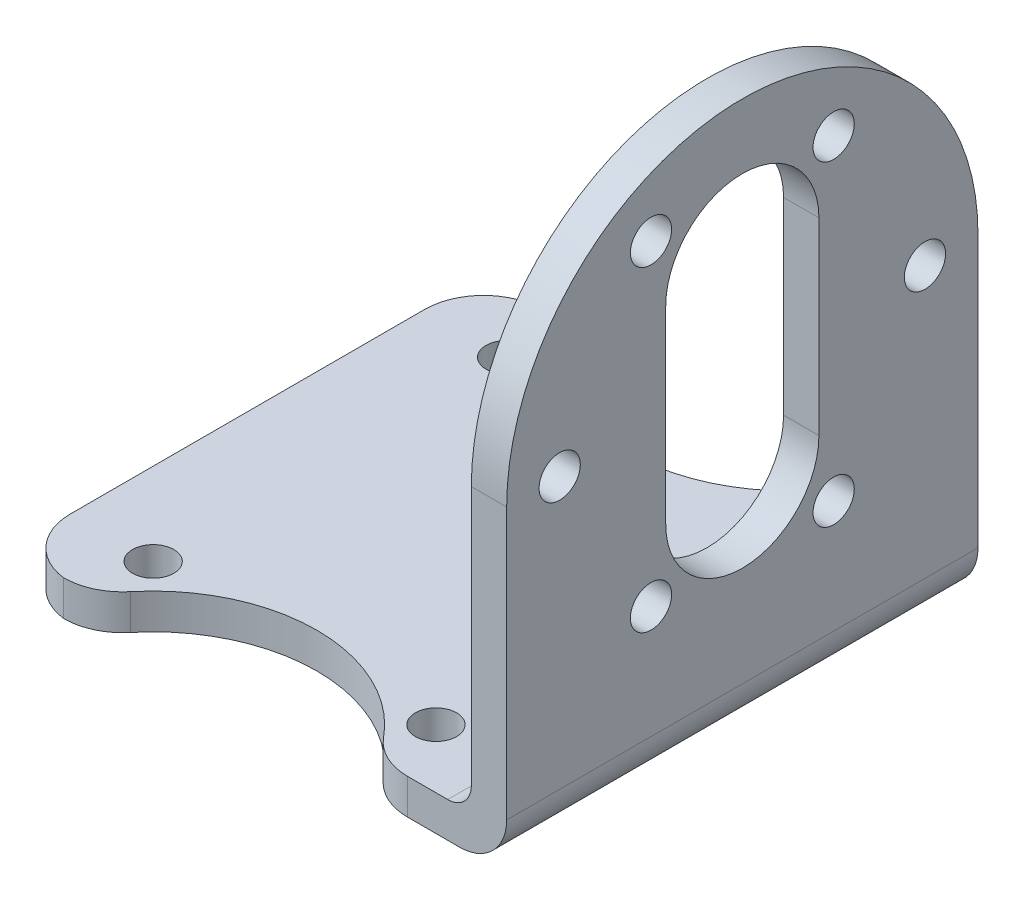
ISO-10303-21;
HEADER;
FILE_DESCRIPTION(('STEP AP214'),'2;1');
FILE_NAME('part.step','',(''),(''),'','','');
FILE_SCHEMA(('AUTOMOTIVE_DESIGN { 1 0 10303 214 1 1 1 1 }'));
ENDSEC;
DATA;
#1=APPLICATION_CONTEXT('core data for automotive mechanical design processes');
#2=APPLICATION_PROTOCOL_DEFINITION('international standard','automotive_design',2000,#1);
#3=PRODUCT_CONTEXT('',#1,'mechanical');
#4=PRODUCT('Part','Part','',(#3));
#5=PRODUCT_RELATED_PRODUCT_CATEGORY('part','',(#4));
#6=PRODUCT_DEFINITION_FORMATION('','',#4);
#7=PRODUCT_DEFINITION_CONTEXT('part definition',#1,'design');
#8=PRODUCT_DEFINITION('design','',#6,#7);
#9=PRODUCT_DEFINITION_SHAPE('','',#8);
#10=(LENGTH_UNIT() NAMED_UNIT(*) SI_UNIT(.MILLI.,.METRE.));
#11=(NAMED_UNIT(*) PLANE_ANGLE_UNIT() SI_UNIT($,.RADIAN.));
#12=(NAMED_UNIT(*) SI_UNIT($,.STERADIAN.) SOLID_ANGLE_UNIT());
#13=UNCERTAINTY_MEASURE_WITH_UNIT(LENGTH_MEASURE(1.E-05),#10,'distance_accuracy_value','');
#14=(GEOMETRIC_REPRESENTATION_CONTEXT(3) GLOBAL_UNCERTAINTY_ASSIGNED_CONTEXT((#13)) GLOBAL_UNIT_ASSIGNED_CONTEXT((#10,
#11,#12)) REPRESENTATION_CONTEXT('',''));
#15=CARTESIAN_POINT('',(0.,0.,0.));
#16=DIRECTION('',(0.,0.,1.));
#17=DIRECTION('',(1.,0.,0.));
#18=AXIS2_PLACEMENT_3D('',#15,#16,#17);
#19=CARTESIAN_POINT('',(-3.,0.,0.));
#20=DIRECTION('',(1.,0.,0.));
#21=DIRECTION('',(0.,0.,-1.));
#22=AXIS2_PLACEMENT_3D('',#19,#20,#21);
#23=PLANE('',#22);
#24=CARTESIAN_POINT('',(-3.,0.,15.5));
#25=DIRECTION('',(1.,0.,0.));
#26=DIRECTION('',(0.,0.,-1.));
#27=AXIS2_PLACEMENT_3D('',#24,#25,#26);
#28=CIRCLE('',#27,1.75);
#29=CARTESIAN_POINT('',(-3.,0.,13.75));
#30=VERTEX_POINT('',#29);
#31=EDGE_CURVE('E228',#30,#30,#28,.T.);
#32=ORIENTED_EDGE('',*,*,#31,.T.);
#33=EDGE_LOOP('',(#32));
#34=FACE_BOUND('',#33,.T.);
#35=CARTESIAN_POINT('',(-3.,13.4233937586588,7.74999999999997));
#36=DIRECTION('',(1.,0.,0.));
#37=DIRECTION('',(0.,0.,-1.));
#38=AXIS2_PLACEMENT_3D('',#35,#36,#37);
#39=CIRCLE('',#38,1.75);
#40=CARTESIAN_POINT('',(-3.,13.4233937586588,5.99999999999997));
#41=VERTEX_POINT('',#40);
#42=EDGE_CURVE('E225',#41,#41,#39,.T.);
#43=ORIENTED_EDGE('',*,*,#42,.T.);
#44=EDGE_LOOP('',(#43));
#45=FACE_BOUND('',#44,.T.);
#46=CARTESIAN_POINT('',(-3.,13.4233937586588,-7.75000000000006));
#47=DIRECTION('',(1.,0.,0.));
#48=DIRECTION('',(0.,0.,-1.));
#49=AXIS2_PLACEMENT_3D('',#46,#47,#48);
#50=CIRCLE('',#49,1.75);
#51=CARTESIAN_POINT('',(-3.,13.4233937586588,-9.50000000000006));
#52=VERTEX_POINT('',#51);
#53=EDGE_CURVE('E222',#52,#52,#50,.T.);
#54=ORIENTED_EDGE('',*,*,#53,.T.);
#55=EDGE_LOOP('',(#54));
#56=FACE_BOUND('',#55,.T.);
#57=CARTESIAN_POINT('',(-3.,-1.08235921504137E-13,-15.5));
#58=DIRECTION('',(1.,0.,0.));
#59=DIRECTION('',(0.,0.,-1.));
#60=AXIS2_PLACEMENT_3D('',#57,#58,#59);
#61=CIRCLE('',#60,1.75);
#62=CARTESIAN_POINT('',(-3.,-1.08235921504137E-13,-17.25));
#63=VERTEX_POINT('',#62);
#64=EDGE_CURVE('E219',#63,#63,#61,.T.);
#65=ORIENTED_EDGE('',*,*,#64,.T.);
#66=EDGE_LOOP('',(#65));
#67=FACE_BOUND('',#66,.T.);
#68=CARTESIAN_POINT('',(-3.,-13.4233937586589,-7.74999999999987));
#69=DIRECTION('',(1.,0.,0.));
#70=DIRECTION('',(0.,0.,-1.));
#71=AXIS2_PLACEMENT_3D('',#68,#69,#70);
#72=CIRCLE('',#71,1.75);
#73=CARTESIAN_POINT('',(-3.,-13.4233937586589,-9.49999999999988));
#74=VERTEX_POINT('',#73);
#75=EDGE_CURVE('E216',#74,#74,#72,.T.);
#76=ORIENTED_EDGE('',*,*,#75,.T.);
#77=EDGE_LOOP('',(#76));
#78=FACE_BOUND('',#77,.T.);
#79=CARTESIAN_POINT('',(-3.,-13.4233937586587,7.75000000000016));
#80=DIRECTION('',(1.,0.,0.));
#81=DIRECTION('',(0.,0.,-1.));
#82=AXIS2_PLACEMENT_3D('',#79,#80,#81);
#83=CIRCLE('',#82,1.75);
#84=CARTESIAN_POINT('',(-3.,-13.4233937586587,6.00000000000015));
#85=VERTEX_POINT('',#84);
#86=EDGE_CURVE('E213',#85,#85,#83,.T.);
#87=ORIENTED_EDGE('',*,*,#86,.T.);
#88=EDGE_LOOP('',(#87));
#89=FACE_BOUND('',#88,.T.);
#90=CARTESIAN_POINT('',(-3.,8.,0.));
#91=DIRECTION('',(1.,0.,0.));
#92=DIRECTION('',(0.,0.,-1.));
#93=AXIS2_PLACEMENT_3D('',#90,#91,#92);
#94=CIRCLE('',#93,6.5);
#95=CARTESIAN_POINT('',(-3.,8.,-6.5));
#96=VERTEX_POINT('',#95);
#97=CARTESIAN_POINT('',(-3.,8.,6.5));
#98=VERTEX_POINT('',#97);
#99=EDGE_CURVE('E179',#96,#98,#94,.T.);
#100=ORIENTED_EDGE('',*,*,#99,.T.);
#101=DIRECTION('',(0.,1.,0.));
#102=VECTOR('',#101,1.);
#103=CARTESIAN_POINT('',(-3.,0.,6.5));
#104=LINE('',#103,#102);
#105=CARTESIAN_POINT('',(-3.,-8.,6.5));
#106=VERTEX_POINT('',#105);
#107=EDGE_CURVE('E211',#106,#98,#104,.T.);
#108=ORIENTED_EDGE('',*,*,#107,.F.);
#109=CARTESIAN_POINT('',(-3.,-8.,0.));
#110=DIRECTION('',(1.,0.,0.));
#111=DIRECTION('',(0.,0.,-1.));
#112=AXIS2_PLACEMENT_3D('',#109,#110,#111);
#113=CIRCLE('',#112,6.5);
#114=CARTESIAN_POINT('',(-3.,-8.,-6.5));
#115=VERTEX_POINT('',#114);
#116=EDGE_CURVE('E182',#106,#115,#113,.T.);
#117=ORIENTED_EDGE('',*,*,#116,.T.);
#118=DIRECTION('',(0.,1.,0.));
#119=VECTOR('',#118,1.);
#120=CARTESIAN_POINT('',(-3.,0.,-6.5));
#121=LINE('',#120,#119);
#122=EDGE_CURVE('E175',#115,#96,#121,.T.);
#123=ORIENTED_EDGE('',*,*,#122,.T.);
#124=EDGE_LOOP('',(#100,#108,#117,#123));
#125=FACE_BOUND('',#124,.T.);
#126=DIRECTION('',(0.,-1.,0.));
#127=VECTOR('',#126,1.);
#128=CARTESIAN_POINT('',(-3.,0.,-20.));
#129=LINE('',#128,#127);
#130=CARTESIAN_POINT('',(-3.,0.,-20.));
#131=VERTEX_POINT('',#130);
#132=CARTESIAN_POINT('',(-3.,-22.,-20.));
#133=VERTEX_POINT('',#132);
#134=EDGE_CURVE('E196',#131,#133,#129,.T.);
#135=ORIENTED_EDGE('',*,*,#134,.T.);
#136=DIRECTION('',(0.,0.,-1.));
#137=VECTOR('',#136,1.);
#138=CARTESIAN_POINT('',(-3.,-22.,20.));
#139=LINE('',#138,#137);
#140=CARTESIAN_POINT('',(-3.,-22.,20.));
#141=VERTEX_POINT('',#140);
#142=EDGE_CURVE('E60',#133,#141,#139,.F.);
#143=ORIENTED_EDGE('',*,*,#142,.T.);
#144=DIRECTION('',(0.,-1.,0.));
#145=VECTOR('',#144,1.);
#146=CARTESIAN_POINT('',(-3.,0.,20.));
#147=LINE('',#146,#145);
#148=CARTESIAN_POINT('',(-3.,0.,20.));
#149=VERTEX_POINT('',#148);
#150=EDGE_CURVE('E234',#149,#141,#147,.T.);
#151=ORIENTED_EDGE('',*,*,#150,.F.);
#152=CARTESIAN_POINT('',(-3.,0.,0.));
#153=DIRECTION('',(1.,0.,0.));
#154=DIRECTION('',(0.,0.,-1.));
#155=AXIS2_PLACEMENT_3D('',#152,#153,#154);
#156=CIRCLE('',#155,20.);
#157=EDGE_CURVE('E231',#131,#149,#156,.T.);
#158=ORIENTED_EDGE('',*,*,#157,.F.);
#159=EDGE_LOOP('',(#135,#143,#151,#158));
#160=FACE_BOUND('',#159,.T.);
#161=ADVANCED_FACE('F39',(#34,#45,#56,#67,#78,#89,#125,#160),#23,.F.);
#162=CARTESIAN_POINT('',(-3.,0.,0.));
#163=DIRECTION('',(1.,0.,0.));
#164=DIRECTION('',(0.,0.,-1.));
#165=AXIS2_PLACEMENT_3D('',#162,#163,#164);
#166=CYLINDRICAL_SURFACE('',#165,20.);
#167=CARTESIAN_POINT('',(0.,0.,0.));
#168=DIRECTION('',(1.,0.,0.));
#169=DIRECTION('',(0.,0.,-1.));
#170=AXIS2_PLACEMENT_3D('',#167,#168,#169);
#171=CIRCLE('',#170,20.);
#172=CARTESIAN_POINT('',(0.,0.,-20.));
#173=VERTEX_POINT('',#172);
#174=CARTESIAN_POINT('',(0.,0.,20.));
#175=VERTEX_POINT('',#174);
#176=EDGE_CURVE('E264',#173,#175,#171,.T.);
#177=ORIENTED_EDGE('',*,*,#176,.F.);
#178=DIRECTION('',(1.,0.,0.));
#179=VECTOR('',#178,1.);
#180=CARTESIAN_POINT('',(-3.,0.,-20.));
#181=LINE('',#180,#179);
#182=EDGE_CURVE('E269',#131,#173,#181,.T.);
#183=ORIENTED_EDGE('',*,*,#182,.F.);
#184=ORIENTED_EDGE('',*,*,#157,.T.);
#185=DIRECTION('',(1.,0.,0.));
#186=VECTOR('',#185,1.);
#187=CARTESIAN_POINT('',(-3.,0.,20.));
#188=LINE('',#187,#186);
#189=EDGE_CURVE('E278',#149,#175,#188,.T.);
#190=ORIENTED_EDGE('',*,*,#189,.T.);
#191=EDGE_LOOP('',(#177,#183,#184,#190));
#192=FACE_BOUND('',#191,.T.);
#193=ADVANCED_FACE('F427',(#192),#166,.T.);
#194=CARTESIAN_POINT('',(-3.,0.,-20.));
#195=DIRECTION('',(0.,0.,1.));
#196=DIRECTION('',(0.,-1.,0.));
#197=AXIS2_PLACEMENT_3D('',#194,#195,#196);
#198=PLANE('',#197);
#199=DIRECTION('',(0.,-1.,0.));
#200=VECTOR('',#199,1.);
#201=CARTESIAN_POINT('',(0.,0.,-20.));
#202=LINE('',#201,#200);
#203=CARTESIAN_POINT('',(0.,-23.,-20.));
#204=VERTEX_POINT('',#203);
#205=EDGE_CURVE('E201',#173,#204,#202,.T.);
#206=ORIENTED_EDGE('',*,*,#205,.T.);
#207=CARTESIAN_POINT('',(-4.,-23.,-20.));
#208=DIRECTION('',(0.,0.,1.));
#209=DIRECTION('',(0.,-1.,0.));
#210=AXIS2_PLACEMENT_3D('',#207,#208,#209);
#211=CIRCLE('',#210,4.);
#212=CARTESIAN_POINT('',(-4.,-27.,-20.));
#213=VERTEX_POINT('',#212);
#214=EDGE_CURVE('E342',#204,#213,#211,.F.);
#215=ORIENTED_EDGE('',*,*,#214,.T.);
#216=DIRECTION('',(1.,0.,0.));
#217=VECTOR('',#216,1.);
#218=CARTESIAN_POINT('',(-3.,-27.,-20.));
#219=LINE('',#218,#217);
#220=CARTESIAN_POINT('',(-8.40806935685006,-27.,-20.));
#221=VERTEX_POINT('',#220);
#222=EDGE_CURVE('E272',#221,#213,#219,.T.);
#223=ORIENTED_EDGE('',*,*,#222,.F.);
#224=DIRECTION('',(0.,1.,0.));
#225=VECTOR('',#224,1.);
#226=CARTESIAN_POINT('',(-8.40806935685006,-24.,-20.));
#227=LINE('',#226,#225);
#228=CARTESIAN_POINT('',(-8.40806935685006,-24.,-20.));
#229=VERTEX_POINT('',#228);
#230=EDGE_CURVE('E311',#221,#229,#227,.T.);
#231=ORIENTED_EDGE('',*,*,#230,.T.);
#232=DIRECTION('',(-1.,0.,0.));
#233=VECTOR('',#232,1.);
#234=CARTESIAN_POINT('',(0.,-24.,-20.));
#235=LINE('',#234,#233);
#236=CARTESIAN_POINT('',(-5.,-24.,-20.));
#237=VERTEX_POINT('',#236);
#238=EDGE_CURVE('E355',#237,#229,#235,.T.);
#239=ORIENTED_EDGE('',*,*,#238,.F.);
#240=CARTESIAN_POINT('',(-5.,-22.,-20.));
#241=DIRECTION('',(0.,0.,1.));
#242=DIRECTION('',(0.,-1.,0.));
#243=AXIS2_PLACEMENT_3D('',#240,#241,#242);
#244=CIRCLE('',#243,2.);
#245=EDGE_CURVE('E47',#237,#133,#244,.T.);
#246=ORIENTED_EDGE('',*,*,#245,.T.);
#247=ORIENTED_EDGE('',*,*,#134,.F.);
#248=ORIENTED_EDGE('',*,*,#182,.T.);
#249=EDGE_LOOP('',(#206,#215,#223,#231,#239,#246,#247,#248));
#250=FACE_BOUND('',#249,.T.);
#251=ADVANCED_FACE('F359',(#250),#198,.F.);
#252=CARTESIAN_POINT('',(-3.,-27.,0.));
#253=DIRECTION('',(0.,-1.,0.));
#254=DIRECTION('',(0.,0.,-1.));
#255=AXIS2_PLACEMENT_3D('',#252,#253,#254);
#256=PLANE('',#255);
#257=ORIENTED_EDGE('',*,*,#222,.T.);
#258=DIRECTION('',(0.,0.,-1.));
#259=VECTOR('',#258,1.);
#260=CARTESIAN_POINT('',(-4.,-27.,0.));
#261=LINE('',#260,#259);
#262=CARTESIAN_POINT('',(-4.,-27.,20.));
#263=VERTEX_POINT('',#262);
#264=EDGE_CURVE('E344',#213,#263,#261,.F.);
#265=ORIENTED_EDGE('',*,*,#264,.T.);
#266=DIRECTION('',(1.,0.,0.));
#267=VECTOR('',#266,1.);
#268=CARTESIAN_POINT('',(-3.,-27.,20.));
#269=LINE('',#268,#267);
#270=CARTESIAN_POINT('',(-8.40806935685006,-27.,20.));
#271=VERTEX_POINT('',#270);
#272=EDGE_CURVE('E275',#271,#263,#269,.T.);
#273=ORIENTED_EDGE('',*,*,#272,.F.);
#274=CARTESIAN_POINT('',(-8.40806935685006,-27.,15.));
#275=DIRECTION('',(0.,-1.,0.));
#276=DIRECTION('',(0.,0.,-1.));
#277=AXIS2_PLACEMENT_3D('',#274,#275,#276);
#278=CIRCLE('',#277,5.);
#279=CARTESIAN_POINT('',(-12.2699123908425,-27.,18.1758728533749));
#280=VERTEX_POINT('',#279);
#281=EDGE_CURVE('E286',#271,#280,#278,.T.);
#282=ORIENTED_EDGE('',*,*,#281,.T.);
#283=CARTESIAN_POINT('',(-23.,-27.,27.));
#284=DIRECTION('',(0.,-1.,0.));
#285=DIRECTION('',(0.,0.,-1.));
#286=AXIS2_PLACEMENT_3D('',#283,#284,#285);
#287=CIRCLE('',#286,13.8924439894498);
#288=CARTESIAN_POINT('',(-33.7300876091575,-27.,18.1758728533749));
#289=VERTEX_POINT('',#288);
#290=EDGE_CURVE('E388',#289,#280,#287,.T.);
#291=ORIENTED_EDGE('',*,*,#290,.F.);
#292=CARTESIAN_POINT('',(-37.5919306431499,-27.,15.));
#293=DIRECTION('',(0.,-1.,0.));
#294=DIRECTION('',(0.,0.,-1.));
#295=AXIS2_PLACEMENT_3D('',#292,#293,#294);
#296=CIRCLE('',#295,5.);
#297=CARTESIAN_POINT('',(-37.5919306431499,-27.,20.));
#298=VERTEX_POINT('',#297);
#299=EDGE_CURVE('E298',#289,#298,#296,.T.);
#300=ORIENTED_EDGE('',*,*,#299,.T.);
#301=CARTESIAN_POINT('',(-37.,-27.,15.0351618240168));
#302=DIRECTION('',(0.,-1.,0.));
#303=DIRECTION('',(0.,0.,-1.));
#304=AXIS2_PLACEMENT_3D('',#301,#302,#303);
#305=CIRCLE('',#304,5.);
#306=CARTESIAN_POINT('',(-42.,-27.,15.0351618240168));
#307=VERTEX_POINT('',#306);
#308=EDGE_CURVE('E326',#298,#307,#305,.T.);
#309=ORIENTED_EDGE('',*,*,#308,.T.);
#310=DIRECTION('',(0.,0.,-1.));
#311=VECTOR('',#310,1.);
#312=CARTESIAN_POINT('',(-42.,-27.,0.));
#313=LINE('',#312,#311);
#314=CARTESIAN_POINT('',(-42.,-27.,-15.0351618240168));
#315=VERTEX_POINT('',#314);
#316=EDGE_CURVE('E207',#307,#315,#313,.T.);
#317=ORIENTED_EDGE('',*,*,#316,.T.);
#318=CARTESIAN_POINT('',(-37.,-27.,-15.0351618240168));
#319=DIRECTION('',(0.,-1.,0.));
#320=DIRECTION('',(0.,0.,-1.));
#321=AXIS2_PLACEMENT_3D('',#318,#319,#320);
#322=CIRCLE('',#321,5.);
#323=CARTESIAN_POINT('',(-37.5919306431499,-27.,-20.));
#324=VERTEX_POINT('',#323);
#325=EDGE_CURVE('E335',#315,#324,#322,.T.);
#326=ORIENTED_EDGE('',*,*,#325,.T.);
#327=CARTESIAN_POINT('',(-37.5919306431499,-27.,-15.));
#328=DIRECTION('',(0.,-1.,0.));
#329=DIRECTION('',(0.,0.,-1.));
#330=AXIS2_PLACEMENT_3D('',#327,#328,#329);
#331=CIRCLE('',#330,5.);
#332=CARTESIAN_POINT('',(-33.7300876091575,-27.,-18.1758728533749));
#333=VERTEX_POINT('',#332);
#334=EDGE_CURVE('E320',#324,#333,#331,.T.);
#335=ORIENTED_EDGE('',*,*,#334,.T.);
#336=CARTESIAN_POINT('',(-23.,-27.,-27.));
#337=DIRECTION('',(0.,-1.,0.));
#338=DIRECTION('',(0.,0.,-1.));
#339=AXIS2_PLACEMENT_3D('',#336,#337,#338);
#340=CIRCLE('',#339,13.8924439894498);
#341=CARTESIAN_POINT('',(-12.2699123908425,-27.,-18.1758728533749));
#342=VERTEX_POINT('',#341);
#343=EDGE_CURVE('E387',#333,#342,#340,.F.);
#344=ORIENTED_EDGE('',*,*,#343,.T.);
#345=CARTESIAN_POINT('',(-8.40806935685006,-27.,-15.));
#346=DIRECTION('',(0.,-1.,0.));
#347=DIRECTION('',(0.,0.,-1.));
#348=AXIS2_PLACEMENT_3D('',#345,#346,#347);
#349=CIRCLE('',#348,5.);
#350=EDGE_CURVE('E309',#342,#221,#349,.T.);
#351=ORIENTED_EDGE('',*,*,#350,.T.);
#352=EDGE_LOOP('',(#257,#265,#273,#282,#291,#300,#309,#317,#326,#335,#344,#351));
#353=FACE_BOUND('',#352,.T.);
#354=CARTESIAN_POINT('',(-35.,-27.,-15.));
#355=DIRECTION('',(0.,-1.,0.));
#356=DIRECTION('',(0.,0.,-1.));
#357=AXIS2_PLACEMENT_3D('',#354,#355,#356);
#358=CIRCLE('',#357,1.75);
#359=CARTESIAN_POINT('',(-35.,-27.,-16.75));
#360=VERTEX_POINT('',#359);
#361=EDGE_CURVE('E375',#360,#360,#358,.T.);
#362=ORIENTED_EDGE('',*,*,#361,.F.);
#363=EDGE_LOOP('',(#362));
#364=FACE_BOUND('',#363,.T.);
#365=CARTESIAN_POINT('',(-35.,-27.,15.));
#366=DIRECTION('',(0.,-1.,0.));
#367=DIRECTION('',(0.,0.,-1.));
#368=AXIS2_PLACEMENT_3D('',#365,#366,#367);
#369=CIRCLE('',#368,1.75);
#370=CARTESIAN_POINT('',(-35.,-27.,13.25));
#371=VERTEX_POINT('',#370);
#372=EDGE_CURVE('E378',#371,#371,#369,.T.);
#373=ORIENTED_EDGE('',*,*,#372,.F.);
#374=EDGE_LOOP('',(#373));
#375=FACE_BOUND('',#374,.T.);
#376=CARTESIAN_POINT('',(-11.,-27.,-15.));
#377=DIRECTION('',(0.,-1.,0.));
#378=DIRECTION('',(0.,0.,-1.));
#379=AXIS2_PLACEMENT_3D('',#376,#377,#378);
#380=CIRCLE('',#379,1.75);
#381=CARTESIAN_POINT('',(-11.,-27.,-16.75));
#382=VERTEX_POINT('',#381);
#383=EDGE_CURVE('E381',#382,#382,#380,.T.);
#384=ORIENTED_EDGE('',*,*,#383,.F.);
#385=EDGE_LOOP('',(#384));
#386=FACE_BOUND('',#385,.T.);
#387=CARTESIAN_POINT('',(-11.,-27.,15.));
#388=DIRECTION('',(0.,-1.,0.));
#389=DIRECTION('',(0.,0.,-1.));
#390=AXIS2_PLACEMENT_3D('',#387,#388,#389);
#391=CIRCLE('',#390,1.75);
#392=CARTESIAN_POINT('',(-11.,-27.,13.25));
#393=VERTEX_POINT('',#392);
#394=EDGE_CURVE('E384',#393,#393,#391,.T.);
#395=ORIENTED_EDGE('',*,*,#394,.F.);
#396=EDGE_LOOP('',(#395));
#397=FACE_BOUND('',#396,.T.);
#398=ADVANCED_FACE('F418',(#353,#364,#375,#386,#397),#256,.T.);
#399=CARTESIAN_POINT('',(-3.,8.,0.));
#400=DIRECTION('',(1.,0.,0.));
#401=DIRECTION('',(0.,0.,-1.));
#402=AXIS2_PLACEMENT_3D('',#399,#400,#401);
#403=CYLINDRICAL_SURFACE('',#402,6.5);
#404=CARTESIAN_POINT('',(0.,8.,0.));
#405=DIRECTION('',(1.,0.,0.));
#406=DIRECTION('',(0.,0.,-1.));
#407=AXIS2_PLACEMENT_3D('',#404,#405,#406);
#408=CIRCLE('',#407,6.5);
#409=CARTESIAN_POINT('',(0.,8.,-6.5));
#410=VERTEX_POINT('',#409);
#411=CARTESIAN_POINT('',(0.,8.,6.5));
#412=VERTEX_POINT('',#411);
#413=EDGE_CURVE('E237',#410,#412,#408,.T.);
#414=ORIENTED_EDGE('',*,*,#413,.T.);
#415=DIRECTION('',(1.,0.,0.));
#416=VECTOR('',#415,1.);
#417=CARTESIAN_POINT('',(-3.,8.,6.5));
#418=LINE('',#417,#416);
#419=EDGE_CURVE('E199',#98,#412,#418,.T.);
#420=ORIENTED_EDGE('',*,*,#419,.F.);
#421=ORIENTED_EDGE('',*,*,#99,.F.);
#422=DIRECTION('',(1.,0.,0.));
#423=VECTOR('',#422,1.);
#424=CARTESIAN_POINT('',(-3.,8.,-6.5));
#425=LINE('',#424,#423);
#426=EDGE_CURVE('E188',#96,#410,#425,.T.);
#427=ORIENTED_EDGE('',*,*,#426,.T.);
#428=EDGE_LOOP('',(#414,#420,#421,#427));
#429=FACE_BOUND('',#428,.T.);
#430=ADVANCED_FACE('F198',(#429),#403,.F.);
#431=CARTESIAN_POINT('',(-3.,0.,6.5));
#432=DIRECTION('',(0.,0.,-1.));
#433=DIRECTION('',(0.,1.,0.));
#434=AXIS2_PLACEMENT_3D('',#431,#432,#433);
#435=PLANE('',#434);
#436=DIRECTION('',(0.,1.,0.));
#437=VECTOR('',#436,1.);
#438=CARTESIAN_POINT('',(0.,0.,6.5));
#439=LINE('',#438,#437);
#440=CARTESIAN_POINT('',(0.,-8.,6.5));
#441=VERTEX_POINT('',#440);
#442=EDGE_CURVE('E243',#441,#412,#439,.T.);
#443=ORIENTED_EDGE('',*,*,#442,.F.);
#444=DIRECTION('',(1.,0.,0.));
#445=VECTOR('',#444,1.);
#446=CARTESIAN_POINT('',(-3.,-8.,6.5));
#447=LINE('',#446,#445);
#448=EDGE_CURVE('E281',#106,#441,#447,.T.);
#449=ORIENTED_EDGE('',*,*,#448,.F.);
#450=ORIENTED_EDGE('',*,*,#107,.T.);
#451=ORIENTED_EDGE('',*,*,#419,.T.);
#452=EDGE_LOOP('',(#443,#449,#450,#451));
#453=FACE_BOUND('',#452,.T.);
#454=ADVANCED_FACE('F425',(#453),#435,.T.);
#455=CARTESIAN_POINT('',(-3.,-8.,0.));
#456=DIRECTION('',(1.,0.,0.));
#457=DIRECTION('',(0.,0.,-1.));
#458=AXIS2_PLACEMENT_3D('',#455,#456,#457);
#459=CYLINDRICAL_SURFACE('',#458,6.5);
#460=CARTESIAN_POINT('',(0.,-8.,0.));
#461=DIRECTION('',(1.,0.,0.));
#462=DIRECTION('',(0.,0.,-1.));
#463=AXIS2_PLACEMENT_3D('',#460,#461,#462);
#464=CIRCLE('',#463,6.5);
#465=CARTESIAN_POINT('',(0.,-8.,-6.5));
#466=VERTEX_POINT('',#465);
#467=EDGE_CURVE('E241',#441,#466,#464,.T.);
#468=ORIENTED_EDGE('',*,*,#467,.T.);
#469=DIRECTION('',(1.,0.,0.));
#470=VECTOR('',#469,1.);
#471=CARTESIAN_POINT('',(-3.,-8.,-6.5));
#472=LINE('',#471,#470);
#473=EDGE_CURVE('E195',#115,#466,#472,.T.);
#474=ORIENTED_EDGE('',*,*,#473,.F.);
#475=ORIENTED_EDGE('',*,*,#116,.F.);
#476=ORIENTED_EDGE('',*,*,#448,.T.);
#477=EDGE_LOOP('',(#468,#474,#475,#476));
#478=FACE_BOUND('',#477,.T.);
#479=ADVANCED_FACE('F534',(#478),#459,.F.);
#480=CARTESIAN_POINT('',(-3.,0.,15.5));
#481=DIRECTION('',(1.,0.,0.));
#482=DIRECTION('',(0.,0.,-1.));
#483=AXIS2_PLACEMENT_3D('',#480,#481,#482);
#484=CYLINDRICAL_SURFACE('',#483,1.75);
#485=ORIENTED_EDGE('',*,*,#31,.F.);
#486=EDGE_LOOP('',(#485));
#487=FACE_BOUND('',#486,.T.);
#488=CARTESIAN_POINT('',(0.,0.,15.5));
#489=DIRECTION('',(1.,0.,0.));
#490=DIRECTION('',(0.,0.,-1.));
#491=AXIS2_PLACEMENT_3D('',#488,#489,#490);
#492=CIRCLE('',#491,1.75);
#493=CARTESIAN_POINT('',(0.,0.,13.75));
#494=VERTEX_POINT('',#493);
#495=EDGE_CURVE('E261',#494,#494,#492,.T.);
#496=ORIENTED_EDGE('',*,*,#495,.T.);
#497=EDGE_LOOP('',(#496));
#498=FACE_BOUND('',#497,.T.);
#499=ADVANCED_FACE('F537',(#487,#498),#484,.F.);
#500=CARTESIAN_POINT('',(-3.,13.4233937586588,7.74999999999997));
#501=DIRECTION('',(1.,0.,0.));
#502=DIRECTION('',(0.,0.,-1.));
#503=AXIS2_PLACEMENT_3D('',#500,#501,#502);
#504=CYLINDRICAL_SURFACE('',#503,1.75);
#505=ORIENTED_EDGE('',*,*,#42,.F.);
#506=EDGE_LOOP('',(#505));
#507=FACE_BOUND('',#506,.T.);
#508=CARTESIAN_POINT('',(0.,13.4233937586588,7.74999999999997));
#509=DIRECTION('',(1.,0.,0.));
#510=DIRECTION('',(0.,0.,-1.));
#511=AXIS2_PLACEMENT_3D('',#508,#509,#510);
#512=CIRCLE('',#511,1.75);
#513=CARTESIAN_POINT('',(0.,13.4233937586588,5.99999999999997));
#514=VERTEX_POINT('',#513);
#515=EDGE_CURVE('E258',#514,#514,#512,.T.);
#516=ORIENTED_EDGE('',*,*,#515,.T.);
#517=EDGE_LOOP('',(#516));
#518=FACE_BOUND('',#517,.T.);
#519=ADVANCED_FACE('F556',(#507,#518),#504,.F.);
#520=CARTESIAN_POINT('',(-3.,13.4233937586588,-7.75000000000006));
#521=DIRECTION('',(1.,0.,0.));
#522=DIRECTION('',(0.,0.,-1.));
#523=AXIS2_PLACEMENT_3D('',#520,#521,#522);
#524=CYLINDRICAL_SURFACE('',#523,1.75);
#525=ORIENTED_EDGE('',*,*,#53,.F.);
#526=EDGE_LOOP('',(#525));
#527=FACE_BOUND('',#526,.T.);
#528=CARTESIAN_POINT('',(0.,13.4233937586588,-7.75000000000006));
#529=DIRECTION('',(1.,0.,0.));
#530=DIRECTION('',(0.,0.,-1.));
#531=AXIS2_PLACEMENT_3D('',#528,#529,#530);
#532=CIRCLE('',#531,1.75);
#533=CARTESIAN_POINT('',(0.,13.4233937586588,-9.50000000000006));
#534=VERTEX_POINT('',#533);
#535=EDGE_CURVE('E255',#534,#534,#532,.T.);
#536=ORIENTED_EDGE('',*,*,#535,.T.);
#537=EDGE_LOOP('',(#536));
#538=FACE_BOUND('',#537,.T.);
#539=ADVANCED_FACE('F552',(#527,#538),#524,.F.);
#540=CARTESIAN_POINT('',(-3.,-1.08235921504137E-13,-15.5));
#541=DIRECTION('',(1.,0.,0.));
#542=DIRECTION('',(0.,0.,-1.));
#543=AXIS2_PLACEMENT_3D('',#540,#541,#542);
#544=CYLINDRICAL_SURFACE('',#543,1.75);
#545=ORIENTED_EDGE('',*,*,#64,.F.);
#546=EDGE_LOOP('',(#545));
#547=FACE_BOUND('',#546,.T.);
#548=CARTESIAN_POINT('',(0.,-1.08235921504137E-13,-15.5));
#549=DIRECTION('',(1.,0.,0.));
#550=DIRECTION('',(0.,0.,-1.));
#551=AXIS2_PLACEMENT_3D('',#548,#549,#550);
#552=CIRCLE('',#551,1.75);
#553=CARTESIAN_POINT('',(0.,-1.08235921504137E-13,-17.25));
#554=VERTEX_POINT('',#553);
#555=EDGE_CURVE('E252',#554,#554,#552,.T.);
#556=ORIENTED_EDGE('',*,*,#555,.T.);
#557=EDGE_LOOP('',(#556));
#558=FACE_BOUND('',#557,.T.);
#559=ADVANCED_FACE('F548',(#547,#558),#544,.F.);
#560=CARTESIAN_POINT('',(-3.,-13.4233937586589,-7.74999999999987));
#561=DIRECTION('',(1.,0.,0.));
#562=DIRECTION('',(0.,0.,-1.));
#563=AXIS2_PLACEMENT_3D('',#560,#561,#562);
#564=CYLINDRICAL_SURFACE('',#563,1.75);
#565=ORIENTED_EDGE('',*,*,#75,.F.);
#566=EDGE_LOOP('',(#565));
#567=FACE_BOUND('',#566,.T.);
#568=CARTESIAN_POINT('',(0.,-13.4233937586589,-7.74999999999987));
#569=DIRECTION('',(1.,0.,0.));
#570=DIRECTION('',(0.,0.,-1.));
#571=AXIS2_PLACEMENT_3D('',#568,#569,#570);
#572=CIRCLE('',#571,1.75);
#573=CARTESIAN_POINT('',(0.,-13.4233937586589,-9.49999999999988));
#574=VERTEX_POINT('',#573);
#575=EDGE_CURVE('E249',#574,#574,#572,.T.);
#576=ORIENTED_EDGE('',*,*,#575,.T.);
#577=EDGE_LOOP('',(#576));
#578=FACE_BOUND('',#577,.T.);
#579=ADVANCED_FACE('F544',(#567,#578),#564,.F.);
#580=CARTESIAN_POINT('',(-3.,-13.4233937586587,7.75000000000016));
#581=DIRECTION('',(1.,0.,0.));
#582=DIRECTION('',(0.,0.,-1.));
#583=AXIS2_PLACEMENT_3D('',#580,#581,#582);
#584=CYLINDRICAL_SURFACE('',#583,1.75);
#585=ORIENTED_EDGE('',*,*,#86,.F.);
#586=EDGE_LOOP('',(#585));
#587=FACE_BOUND('',#586,.T.);
#588=CARTESIAN_POINT('',(0.,-13.4233937586587,7.75000000000016));
#589=DIRECTION('',(1.,0.,0.));
#590=DIRECTION('',(0.,0.,-1.));
#591=AXIS2_PLACEMENT_3D('',#588,#589,#590);
#592=CIRCLE('',#591,1.75);
#593=CARTESIAN_POINT('',(0.,-13.4233937586587,6.00000000000015));
#594=VERTEX_POINT('',#593);
#595=EDGE_CURVE('E246',#594,#594,#592,.T.);
#596=ORIENTED_EDGE('',*,*,#595,.T.);
#597=EDGE_LOOP('',(#596));
#598=FACE_BOUND('',#597,.T.);
#599=ADVANCED_FACE('F533',(#587,#598),#584,.F.);
#600=CARTESIAN_POINT('',(-3.,0.,-6.5));
#601=DIRECTION('',(0.,0.,-1.));
#602=DIRECTION('',(0.,1.,0.));
#603=AXIS2_PLACEMENT_3D('',#600,#601,#602);
#604=PLANE('',#603);
#605=DIRECTION('',(0.,1.,0.));
#606=VECTOR('',#605,1.);
#607=CARTESIAN_POINT('',(0.,0.,-6.5));
#608=LINE('',#607,#606);
#609=EDGE_CURVE('E191',#466,#410,#608,.T.);
#610=ORIENTED_EDGE('',*,*,#609,.T.);
#611=ORIENTED_EDGE('',*,*,#426,.F.);
#612=ORIENTED_EDGE('',*,*,#122,.F.);
#613=ORIENTED_EDGE('',*,*,#473,.T.);
#614=EDGE_LOOP('',(#610,#611,#612,#613));
#615=FACE_BOUND('',#614,.T.);
#616=ADVANCED_FACE('F189',(#615),#604,.F.);
#617=CARTESIAN_POINT('',(-3.,0.,20.));
#618=DIRECTION('',(0.,0.,1.));
#619=DIRECTION('',(0.,-1.,0.));
#620=AXIS2_PLACEMENT_3D('',#617,#618,#619);
#621=PLANE('',#620);
#622=ORIENTED_EDGE('',*,*,#272,.T.);
#623=CARTESIAN_POINT('',(-4.,-23.,20.));
#624=DIRECTION('',(0.,0.,1.));
#625=DIRECTION('',(0.,-1.,0.));
#626=AXIS2_PLACEMENT_3D('',#623,#624,#625);
#627=CIRCLE('',#626,4.);
#628=CARTESIAN_POINT('',(0.,-23.,20.));
#629=VERTEX_POINT('',#628);
#630=EDGE_CURVE('E346',#263,#629,#627,.T.);
#631=ORIENTED_EDGE('',*,*,#630,.T.);
#632=DIRECTION('',(0.,-1.,0.));
#633=VECTOR('',#632,1.);
#634=CARTESIAN_POINT('',(0.,0.,20.));
#635=LINE('',#634,#633);
#636=EDGE_CURVE('E204',#175,#629,#635,.T.);
#637=ORIENTED_EDGE('',*,*,#636,.F.);
#638=ORIENTED_EDGE('',*,*,#189,.F.);
#639=ORIENTED_EDGE('',*,*,#150,.T.);
#640=CARTESIAN_POINT('',(-5.,-22.,20.));
#641=DIRECTION('',(0.,0.,1.));
#642=DIRECTION('',(0.,-1.,0.));
#643=AXIS2_PLACEMENT_3D('',#640,#641,#642);
#644=CIRCLE('',#643,2.);
#645=CARTESIAN_POINT('',(-5.,-24.,20.));
#646=VERTEX_POINT('',#645);
#647=EDGE_CURVE('E11',#141,#646,#644,.F.);
#648=ORIENTED_EDGE('',*,*,#647,.T.);
#649=DIRECTION('',(-1.,0.,0.));
#650=VECTOR('',#649,1.);
#651=CARTESIAN_POINT('',(0.,-24.,20.));
#652=LINE('',#651,#650);
#653=CARTESIAN_POINT('',(-8.40806935685006,-24.,20.));
#654=VERTEX_POINT('',#653);
#655=EDGE_CURVE('E356',#646,#654,#652,.T.);
#656=ORIENTED_EDGE('',*,*,#655,.T.);
#657=DIRECTION('',(0.,1.,0.));
#658=VECTOR('',#657,1.);
#659=CARTESIAN_POINT('',(-8.40806935685006,-27.,20.));
#660=LINE('',#659,#658);
#661=EDGE_CURVE('E271',#654,#271,#660,.F.);
#662=ORIENTED_EDGE('',*,*,#661,.T.);
#663=EDGE_LOOP('',(#622,#631,#637,#638,#639,#648,#656,#662));
#664=FACE_BOUND('',#663,.T.);
#665=ADVANCED_FACE('F447',(#664),#621,.T.);
#666=CARTESIAN_POINT('',(0.,0.,0.));
#667=DIRECTION('',(1.,0.,0.));
#668=DIRECTION('',(0.,0.,-1.));
#669=AXIS2_PLACEMENT_3D('',#666,#667,#668);
#670=PLANE('',#669);
#671=ORIENTED_EDGE('',*,*,#413,.F.);
#672=ORIENTED_EDGE('',*,*,#609,.F.);
#673=ORIENTED_EDGE('',*,*,#467,.F.);
#674=ORIENTED_EDGE('',*,*,#442,.T.);
#675=EDGE_LOOP('',(#671,#672,#673,#674));
#676=FACE_BOUND('',#675,.T.);
#677=ORIENTED_EDGE('',*,*,#595,.F.);
#678=EDGE_LOOP('',(#677));
#679=FACE_BOUND('',#678,.T.);
#680=ORIENTED_EDGE('',*,*,#575,.F.);
#681=EDGE_LOOP('',(#680));
#682=FACE_BOUND('',#681,.T.);
#683=ORIENTED_EDGE('',*,*,#555,.F.);
#684=EDGE_LOOP('',(#683));
#685=FACE_BOUND('',#684,.T.);
#686=ORIENTED_EDGE('',*,*,#535,.F.);
#687=EDGE_LOOP('',(#686));
#688=FACE_BOUND('',#687,.T.);
#689=ORIENTED_EDGE('',*,*,#515,.F.);
#690=EDGE_LOOP('',(#689));
#691=FACE_BOUND('',#690,.T.);
#692=ORIENTED_EDGE('',*,*,#495,.F.);
#693=EDGE_LOOP('',(#692));
#694=FACE_BOUND('',#693,.T.);
#695=ORIENTED_EDGE('',*,*,#636,.T.);
#696=DIRECTION('',(0.,0.,-1.));
#697=VECTOR('',#696,1.);
#698=CARTESIAN_POINT('',(0.,-23.,0.));
#699=LINE('',#698,#697);
#700=EDGE_CURVE('E339',#629,#204,#699,.T.);
#701=ORIENTED_EDGE('',*,*,#700,.T.);
#702=ORIENTED_EDGE('',*,*,#205,.F.);
#703=ORIENTED_EDGE('',*,*,#176,.T.);
#704=EDGE_LOOP('',(#695,#701,#702,#703));
#705=FACE_BOUND('',#704,.T.);
#706=ADVANCED_FACE('F444',(#676,#679,#682,#685,#688,#691,#694,#705),#670,.T.);
#707=CARTESIAN_POINT('',(-42.,-24.,0.));
#708=DIRECTION('',(-1.,0.,0.));
#709=DIRECTION('',(0.,0.,1.));
#710=AXIS2_PLACEMENT_3D('',#707,#708,#709);
#711=PLANE('',#710);
#712=DIRECTION('',(0.,0.,-1.));
#713=VECTOR('',#712,1.);
#714=CARTESIAN_POINT('',(-42.,-24.,0.));
#715=LINE('',#714,#713);
#716=CARTESIAN_POINT('',(-42.,-24.,15.0351618240168));
#717=VERTEX_POINT('',#716);
#718=CARTESIAN_POINT('',(-42.,-24.,-15.0351618240168));
#719=VERTEX_POINT('',#718);
#720=EDGE_CURVE('E239',#717,#719,#715,.T.);
#721=ORIENTED_EDGE('',*,*,#720,.T.);
#722=DIRECTION('',(0.,-1.,0.));
#723=VECTOR('',#722,1.);
#724=CARTESIAN_POINT('',(-42.,-27.,-15.0351618240168));
#725=LINE('',#724,#723);
#726=EDGE_CURVE('E332',#719,#315,#725,.T.);
#727=ORIENTED_EDGE('',*,*,#726,.T.);
#728=ORIENTED_EDGE('',*,*,#316,.F.);
#729=DIRECTION('',(0.,-1.,0.));
#730=VECTOR('',#729,1.);
#731=CARTESIAN_POINT('',(-42.,-24.,15.0351618240168));
#732=LINE('',#731,#730);
#733=EDGE_CURVE('E328',#307,#717,#732,.F.);
#734=ORIENTED_EDGE('',*,*,#733,.T.);
#735=EDGE_LOOP('',(#721,#727,#728,#734));
#736=FACE_BOUND('',#735,.T.);
#737=ADVANCED_FACE('F446',(#736),#711,.T.);
#738=CARTESIAN_POINT('',(-23.,-24.,27.));
#739=DIRECTION('',(0.,-1.,0.));
#740=DIRECTION('',(0.,0.,-1.));
#741=AXIS2_PLACEMENT_3D('',#738,#739,#740);
#742=CYLINDRICAL_SURFACE('',#741,13.8924439894498);
#743=CARTESIAN_POINT('',(-23.,-24.,27.));
#744=DIRECTION('',(0.,-1.,0.));
#745=DIRECTION('',(0.,0.,-1.));
#746=AXIS2_PLACEMENT_3D('',#743,#744,#745);
#747=CIRCLE('',#746,13.8924439894498);
#748=CARTESIAN_POINT('',(-33.7300876091575,-24.,18.1758728533749));
#749=VERTEX_POINT('',#748);
#750=CARTESIAN_POINT('',(-12.2699123908425,-24.,18.1758728533749));
#751=VERTEX_POINT('',#750);
#752=EDGE_CURVE('E365',#749,#751,#747,.T.);
#753=ORIENTED_EDGE('',*,*,#752,.F.);
#754=DIRECTION('',(0.,-1.,0.));
#755=VECTOR('',#754,1.);
#756=CARTESIAN_POINT('',(-33.7300876091575,-24.,18.1758728533749));
#757=LINE('',#756,#755);
#758=EDGE_CURVE('E295',#749,#289,#757,.T.);
#759=ORIENTED_EDGE('',*,*,#758,.T.);
#760=ORIENTED_EDGE('',*,*,#290,.T.);
#761=DIRECTION('',(0.,-1.,0.));
#762=VECTOR('',#761,1.);
#763=CARTESIAN_POINT('',(-12.2699123908425,-24.,18.1758728533749));
#764=LINE('',#763,#762);
#765=EDGE_CURVE('E289',#280,#751,#764,.F.);
#766=ORIENTED_EDGE('',*,*,#765,.T.);
#767=EDGE_LOOP('',(#753,#759,#760,#766));
#768=FACE_BOUND('',#767,.T.);
#769=ADVANCED_FACE('F414',(#768),#742,.F.);
#770=CARTESIAN_POINT('',(-11.,-24.,15.));
#771=DIRECTION('',(0.,-1.,0.));
#772=DIRECTION('',(0.,0.,-1.));
#773=AXIS2_PLACEMENT_3D('',#770,#771,#772);
#774=CYLINDRICAL_SURFACE('',#773,1.75);
#775=CARTESIAN_POINT('',(-11.,-24.,15.));
#776=DIRECTION('',(0.,-1.,0.));
#777=DIRECTION('',(0.,0.,-1.));
#778=AXIS2_PLACEMENT_3D('',#775,#776,#777);
#779=CIRCLE('',#778,1.75);
#780=CARTESIAN_POINT('',(-11.,-24.,13.25));
#781=VERTEX_POINT('',#780);
#782=EDGE_CURVE('E367',#781,#781,#779,.T.);
#783=ORIENTED_EDGE('',*,*,#782,.F.);
#784=EDGE_LOOP('',(#783));
#785=FACE_BOUND('',#784,.T.);
#786=ORIENTED_EDGE('',*,*,#394,.T.);
#787=EDGE_LOOP('',(#786));
#788=FACE_BOUND('',#787,.T.);
#789=ADVANCED_FACE('F410',(#785,#788),#774,.F.);
#790=CARTESIAN_POINT('',(-11.,-24.,-15.));
#791=DIRECTION('',(0.,-1.,0.));
#792=DIRECTION('',(0.,0.,-1.));
#793=AXIS2_PLACEMENT_3D('',#790,#791,#792);
#794=CYLINDRICAL_SURFACE('',#793,1.75);
#795=CARTESIAN_POINT('',(-11.,-24.,-15.));
#796=DIRECTION('',(0.,-1.,0.));
#797=DIRECTION('',(0.,0.,-1.));
#798=AXIS2_PLACEMENT_3D('',#795,#796,#797);
#799=CIRCLE('',#798,1.75);
#800=CARTESIAN_POINT('',(-11.,-24.,-16.75));
#801=VERTEX_POINT('',#800);
#802=EDGE_CURVE('E401',#801,#801,#799,.T.);
#803=ORIENTED_EDGE('',*,*,#802,.F.);
#804=EDGE_LOOP('',(#803));
#805=FACE_BOUND('',#804,.T.);
#806=ORIENTED_EDGE('',*,*,#383,.T.);
#807=EDGE_LOOP('',(#806));
#808=FACE_BOUND('',#807,.T.);
#809=ADVANCED_FACE('F413',(#805,#808),#794,.F.);
#810=CARTESIAN_POINT('',(-35.,-24.,15.));
#811=DIRECTION('',(0.,-1.,0.));
#812=DIRECTION('',(0.,0.,-1.));
#813=AXIS2_PLACEMENT_3D('',#810,#811,#812);
#814=CYLINDRICAL_SURFACE('',#813,1.75);
#815=CARTESIAN_POINT('',(-35.,-24.,15.));
#816=DIRECTION('',(0.,-1.,0.));
#817=DIRECTION('',(0.,0.,-1.));
#818=AXIS2_PLACEMENT_3D('',#815,#816,#817);
#819=CIRCLE('',#818,1.75);
#820=CARTESIAN_POINT('',(-35.,-24.,13.25));
#821=VERTEX_POINT('',#820);
#822=EDGE_CURVE('E396',#821,#821,#819,.T.);
#823=ORIENTED_EDGE('',*,*,#822,.F.);
#824=EDGE_LOOP('',(#823));
#825=FACE_BOUND('',#824,.T.);
#826=ORIENTED_EDGE('',*,*,#372,.T.);
#827=EDGE_LOOP('',(#826));
#828=FACE_BOUND('',#827,.T.);
#829=ADVANCED_FACE('F698',(#825,#828),#814,.F.);
#830=CARTESIAN_POINT('',(-35.,-24.,-15.));
#831=DIRECTION('',(0.,-1.,0.));
#832=DIRECTION('',(0.,0.,-1.));
#833=AXIS2_PLACEMENT_3D('',#830,#831,#832);
#834=CYLINDRICAL_SURFACE('',#833,1.75);
#835=CARTESIAN_POINT('',(-35.,-24.,-15.));
#836=DIRECTION('',(0.,-1.,0.));
#837=DIRECTION('',(0.,0.,-1.));
#838=AXIS2_PLACEMENT_3D('',#835,#836,#837);
#839=CIRCLE('',#838,1.75);
#840=CARTESIAN_POINT('',(-35.,-24.,-16.75));
#841=VERTEX_POINT('',#840);
#842=EDGE_CURVE('E392',#841,#841,#839,.T.);
#843=ORIENTED_EDGE('',*,*,#842,.F.);
#844=EDGE_LOOP('',(#843));
#845=FACE_BOUND('',#844,.T.);
#846=ORIENTED_EDGE('',*,*,#361,.T.);
#847=EDGE_LOOP('',(#846));
#848=FACE_BOUND('',#847,.T.);
#849=ADVANCED_FACE('F442',(#845,#848),#834,.F.);
#850=CARTESIAN_POINT('',(-23.,-24.,-27.));
#851=DIRECTION('',(0.,-1.,0.));
#852=DIRECTION('',(0.,0.,-1.));
#853=AXIS2_PLACEMENT_3D('',#850,#851,#852);
#854=CYLINDRICAL_SURFACE('',#853,13.8924439894498);
#855=ORIENTED_EDGE('',*,*,#343,.F.);
#856=DIRECTION('',(0.,-1.,0.));
#857=VECTOR('',#856,1.);
#858=CARTESIAN_POINT('',(-33.7300876091575,-24.,-18.1758728533749));
#859=LINE('',#858,#857);
#860=CARTESIAN_POINT('',(-33.7300876091575,-24.,-18.1758728533749));
#861=VERTEX_POINT('',#860);
#862=EDGE_CURVE('E322',#333,#861,#859,.F.);
#863=ORIENTED_EDGE('',*,*,#862,.T.);
#864=CARTESIAN_POINT('',(-23.,-24.,-27.));
#865=DIRECTION('',(0.,-1.,0.));
#866=DIRECTION('',(0.,0.,-1.));
#867=AXIS2_PLACEMENT_3D('',#864,#865,#866);
#868=CIRCLE('',#867,13.8924439894498);
#869=CARTESIAN_POINT('',(-12.2699123908425,-24.,-18.1758728533749));
#870=VERTEX_POINT('',#869);
#871=EDGE_CURVE('E363',#861,#870,#868,.F.);
#872=ORIENTED_EDGE('',*,*,#871,.T.);
#873=DIRECTION('',(0.,-1.,0.));
#874=VECTOR('',#873,1.);
#875=CARTESIAN_POINT('',(-12.2699123908425,-24.,-18.1758728533749));
#876=LINE('',#875,#874);
#877=EDGE_CURVE('E306',#870,#342,#876,.T.);
#878=ORIENTED_EDGE('',*,*,#877,.T.);
#879=EDGE_LOOP('',(#855,#863,#872,#878));
#880=FACE_BOUND('',#879,.T.);
#881=ADVANCED_FACE('F484',(#880),#854,.F.);
#882=CARTESIAN_POINT('',(0.,-24.,0.));
#883=DIRECTION('',(0.,-1.,0.));
#884=DIRECTION('',(0.,0.,-1.));
#885=AXIS2_PLACEMENT_3D('',#882,#883,#884);
#886=PLANE('',#885);
#887=ORIENTED_EDGE('',*,*,#842,.T.);
#888=EDGE_LOOP('',(#887));
#889=FACE_BOUND('',#888,.T.);
#890=ORIENTED_EDGE('',*,*,#822,.T.);
#891=EDGE_LOOP('',(#890));
#892=FACE_BOUND('',#891,.T.);
#893=ORIENTED_EDGE('',*,*,#802,.T.);
#894=EDGE_LOOP('',(#893));
#895=FACE_BOUND('',#894,.T.);
#896=ORIENTED_EDGE('',*,*,#782,.T.);
#897=EDGE_LOOP('',(#896));
#898=FACE_BOUND('',#897,.T.);
#899=ORIENTED_EDGE('',*,*,#655,.F.);
#900=DIRECTION('',(0.,0.,-1.));
#901=VECTOR('',#900,1.);
#902=CARTESIAN_POINT('',(-5.,-24.,-20.));
#903=LINE('',#902,#901);
#904=EDGE_CURVE('E348',#646,#237,#903,.T.);
#905=ORIENTED_EDGE('',*,*,#904,.T.);
#906=ORIENTED_EDGE('',*,*,#238,.T.);
#907=CARTESIAN_POINT('',(-8.40806935685006,-24.,-15.));
#908=DIRECTION('',(0.,-1.,0.));
#909=DIRECTION('',(0.,0.,-1.));
#910=AXIS2_PLACEMENT_3D('',#907,#908,#909);
#911=CIRCLE('',#910,5.);
#912=EDGE_CURVE('E314',#229,#870,#911,.F.);
#913=ORIENTED_EDGE('',*,*,#912,.T.);
#914=ORIENTED_EDGE('',*,*,#871,.F.);
#915=CARTESIAN_POINT('',(-37.5919306431499,-24.,-15.));
#916=DIRECTION('',(0.,-1.,0.));
#917=DIRECTION('',(0.,0.,-1.));
#918=AXIS2_PLACEMENT_3D('',#915,#916,#917);
#919=CIRCLE('',#918,5.);
#920=CARTESIAN_POINT('',(-37.5919306431499,-24.,-20.));
#921=VERTEX_POINT('',#920);
#922=EDGE_CURVE('E324',#861,#921,#919,.F.);
#923=ORIENTED_EDGE('',*,*,#922,.T.);
#924=CARTESIAN_POINT('',(-37.,-24.,-15.0351618240168));
#925=DIRECTION('',(0.,-1.,0.));
#926=DIRECTION('',(0.,0.,-1.));
#927=AXIS2_PLACEMENT_3D('',#924,#925,#926);
#928=CIRCLE('',#927,5.);
#929=EDGE_CURVE('E337',#921,#719,#928,.F.);
#930=ORIENTED_EDGE('',*,*,#929,.T.);
#931=ORIENTED_EDGE('',*,*,#720,.F.);
#932=CARTESIAN_POINT('',(-37.,-24.,15.0351618240168));
#933=DIRECTION('',(0.,-1.,0.));
#934=DIRECTION('',(0.,0.,-1.));
#935=AXIS2_PLACEMENT_3D('',#932,#933,#934);
#936=CIRCLE('',#935,5.);
#937=CARTESIAN_POINT('',(-37.5919306431499,-24.,20.));
#938=VERTEX_POINT('',#937);
#939=EDGE_CURVE('E330',#717,#938,#936,.F.);
#940=ORIENTED_EDGE('',*,*,#939,.T.);
#941=CARTESIAN_POINT('',(-37.5919306431499,-24.,15.));
#942=DIRECTION('',(0.,-1.,0.));
#943=DIRECTION('',(0.,0.,-1.));
#944=AXIS2_PLACEMENT_3D('',#941,#942,#943);
#945=CIRCLE('',#944,5.);
#946=EDGE_CURVE('E304',#938,#749,#945,.F.);
#947=ORIENTED_EDGE('',*,*,#946,.T.);
#948=ORIENTED_EDGE('',*,*,#752,.T.);
#949=CARTESIAN_POINT('',(-8.40806935685006,-24.,15.));
#950=DIRECTION('',(0.,-1.,0.));
#951=DIRECTION('',(0.,0.,-1.));
#952=AXIS2_PLACEMENT_3D('',#949,#950,#951);
#953=CIRCLE('',#952,5.);
#954=EDGE_CURVE('E292',#751,#654,#953,.F.);
#955=ORIENTED_EDGE('',*,*,#954,.T.);
#956=EDGE_LOOP('',(#899,#905,#906,#913,#914,#923,#930,#931,#940,#947,#948,#955));
#957=FACE_BOUND('',#956,.T.);
#958=ADVANCED_FACE('F354',(#889,#892,#895,#898,#957),#886,.F.);
#959=CARTESIAN_POINT('',(-8.40806935685006,-24.,15.));
#960=DIRECTION('',(0.,-1.,0.));
#961=DIRECTION('',(0.,0.,-1.));
#962=AXIS2_PLACEMENT_3D('',#959,#960,#961);
#963=CYLINDRICAL_SURFACE('',#962,5.);
#964=ORIENTED_EDGE('',*,*,#954,.F.);
#965=ORIENTED_EDGE('',*,*,#765,.F.);
#966=ORIENTED_EDGE('',*,*,#281,.F.);
#967=ORIENTED_EDGE('',*,*,#661,.F.);
#968=EDGE_LOOP('',(#964,#965,#966,#967));
#969=FACE_BOUND('',#968,.T.);
#970=ADVANCED_FACE('F511',(#969),#963,.T.);
#971=CARTESIAN_POINT('',(-37.5919306431499,-24.,15.));
#972=DIRECTION('',(0.,-1.,0.));
#973=DIRECTION('',(0.,0.,-1.));
#974=AXIS2_PLACEMENT_3D('',#971,#972,#973);
#975=CYLINDRICAL_SURFACE('',#974,5.);
#976=ORIENTED_EDGE('',*,*,#946,.F.);
#977=DIRECTION('',(0.,1.,0.));
#978=VECTOR('',#977,1.);
#979=CARTESIAN_POINT('',(-37.5919306431499,-24.,20.));
#980=LINE('',#979,#978);
#981=EDGE_CURVE('E301',#298,#938,#980,.T.);
#982=ORIENTED_EDGE('',*,*,#981,.F.);
#983=ORIENTED_EDGE('',*,*,#299,.F.);
#984=ORIENTED_EDGE('',*,*,#758,.F.);
#985=EDGE_LOOP('',(#976,#982,#983,#984));
#986=FACE_BOUND('',#985,.T.);
#987=ADVANCED_FACE('F506',(#986),#975,.T.);
#988=CARTESIAN_POINT('',(-8.40806935685006,-24.,-15.));
#989=DIRECTION('',(0.,-1.,0.));
#990=DIRECTION('',(0.,0.,-1.));
#991=AXIS2_PLACEMENT_3D('',#988,#989,#990);
#992=CYLINDRICAL_SURFACE('',#991,5.);
#993=ORIENTED_EDGE('',*,*,#912,.F.);
#994=ORIENTED_EDGE('',*,*,#230,.F.);
#995=ORIENTED_EDGE('',*,*,#350,.F.);
#996=ORIENTED_EDGE('',*,*,#877,.F.);
#997=EDGE_LOOP('',(#993,#994,#995,#996));
#998=FACE_BOUND('',#997,.T.);
#999=ADVANCED_FACE('F482',(#998),#992,.T.);
#1000=CARTESIAN_POINT('',(-37.5919306431499,-24.,-15.));
#1001=DIRECTION('',(0.,-1.,0.));
#1002=DIRECTION('',(0.,0.,-1.));
#1003=AXIS2_PLACEMENT_3D('',#1000,#1001,#1002);
#1004=CYLINDRICAL_SURFACE('',#1003,5.);
#1005=ORIENTED_EDGE('',*,*,#922,.F.);
#1006=ORIENTED_EDGE('',*,*,#862,.F.);
#1007=ORIENTED_EDGE('',*,*,#334,.F.);
#1008=DIRECTION('',(0.,1.,0.));
#1009=VECTOR('',#1008,1.);
#1010=CARTESIAN_POINT('',(-37.5919306431499,-27.,-20.));
#1011=LINE('',#1010,#1009);
#1012=EDGE_CURVE('E317',#921,#324,#1011,.F.);
#1013=ORIENTED_EDGE('',*,*,#1012,.F.);
#1014=EDGE_LOOP('',(#1005,#1006,#1007,#1013));
#1015=FACE_BOUND('',#1014,.T.);
#1016=ADVANCED_FACE('F490',(#1015),#1004,.T.);
#1017=CARTESIAN_POINT('',(-37.,-24.,15.0351618240168));
#1018=DIRECTION('',(0.,1.,0.));
#1019=DIRECTION('',(0.,0.,1.));
#1020=AXIS2_PLACEMENT_3D('',#1017,#1018,#1019);
#1021=CYLINDRICAL_SURFACE('',#1020,5.);
#1022=ORIENTED_EDGE('',*,*,#939,.F.);
#1023=ORIENTED_EDGE('',*,*,#733,.F.);
#1024=ORIENTED_EDGE('',*,*,#308,.F.);
#1025=ORIENTED_EDGE('',*,*,#981,.T.);
#1026=EDGE_LOOP('',(#1022,#1023,#1024,#1025));
#1027=FACE_BOUND('',#1026,.T.);
#1028=ADVANCED_FACE('F500',(#1027),#1021,.T.);
#1029=CARTESIAN_POINT('',(-37.,-24.,-15.0351618240168));
#1030=DIRECTION('',(0.,1.,0.));
#1031=DIRECTION('',(0.,0.,1.));
#1032=AXIS2_PLACEMENT_3D('',#1029,#1030,#1031);
#1033=CYLINDRICAL_SURFACE('',#1032,5.);
#1034=ORIENTED_EDGE('',*,*,#929,.F.);
#1035=ORIENTED_EDGE('',*,*,#1012,.T.);
#1036=ORIENTED_EDGE('',*,*,#325,.F.);
#1037=ORIENTED_EDGE('',*,*,#726,.F.);
#1038=EDGE_LOOP('',(#1034,#1035,#1036,#1037));
#1039=FACE_BOUND('',#1038,.T.);
#1040=ADVANCED_FACE('F495',(#1039),#1033,.T.);
#1041=CARTESIAN_POINT('',(-4.,-23.,0.));
#1042=DIRECTION('',(0.,0.,-1.));
#1043=DIRECTION('',(-1.,0.,0.));
#1044=AXIS2_PLACEMENT_3D('',#1041,#1042,#1043);
#1045=CYLINDRICAL_SURFACE('',#1044,4.);
#1046=ORIENTED_EDGE('',*,*,#630,.F.);
#1047=ORIENTED_EDGE('',*,*,#264,.F.);
#1048=ORIENTED_EDGE('',*,*,#214,.F.);
#1049=ORIENTED_EDGE('',*,*,#700,.F.);
#1050=EDGE_LOOP('',(#1046,#1047,#1048,#1049));
#1051=FACE_BOUND('',#1050,.T.);
#1052=ADVANCED_FACE('F475',(#1051),#1045,.T.);
#1053=CARTESIAN_POINT('',(-5.,-22.,0.));
#1054=DIRECTION('',(0.,0.,1.));
#1055=DIRECTION('',(1.,0.,0.));
#1056=AXIS2_PLACEMENT_3D('',#1053,#1054,#1055);
#1057=CYLINDRICAL_SURFACE('',#1056,2.);
#1058=ORIENTED_EDGE('',*,*,#647,.F.);
#1059=ORIENTED_EDGE('',*,*,#142,.F.);
#1060=ORIENTED_EDGE('',*,*,#245,.F.);
#1061=ORIENTED_EDGE('',*,*,#904,.F.);
#1062=EDGE_LOOP('',(#1058,#1059,#1060,#1061));
#1063=FACE_BOUND('',#1062,.T.);
#1064=ADVANCED_FACE('F41',(#1063),#1057,.F.);
#1065=CLOSED_SHELL('',(#161,#193,#251,#398,#430,#454,#479,#499,#519,#539,#559,#579,#599,#616,
#665,#706,#737,#769,#789,#809,#829,#849,#881,#958,#970,#987,#999,#1016,#1028,#1040,#1052,#1064));
#1066=MANIFOLD_SOLID_BREP('B2',#1065);
#1067=ADVANCED_BREP_SHAPE_REPRESENTATION('',(#18,#1066),#14);
#1068=SHAPE_DEFINITION_REPRESENTATION(#9,#1067);
ENDSEC;
END-ISO-10303-21;
